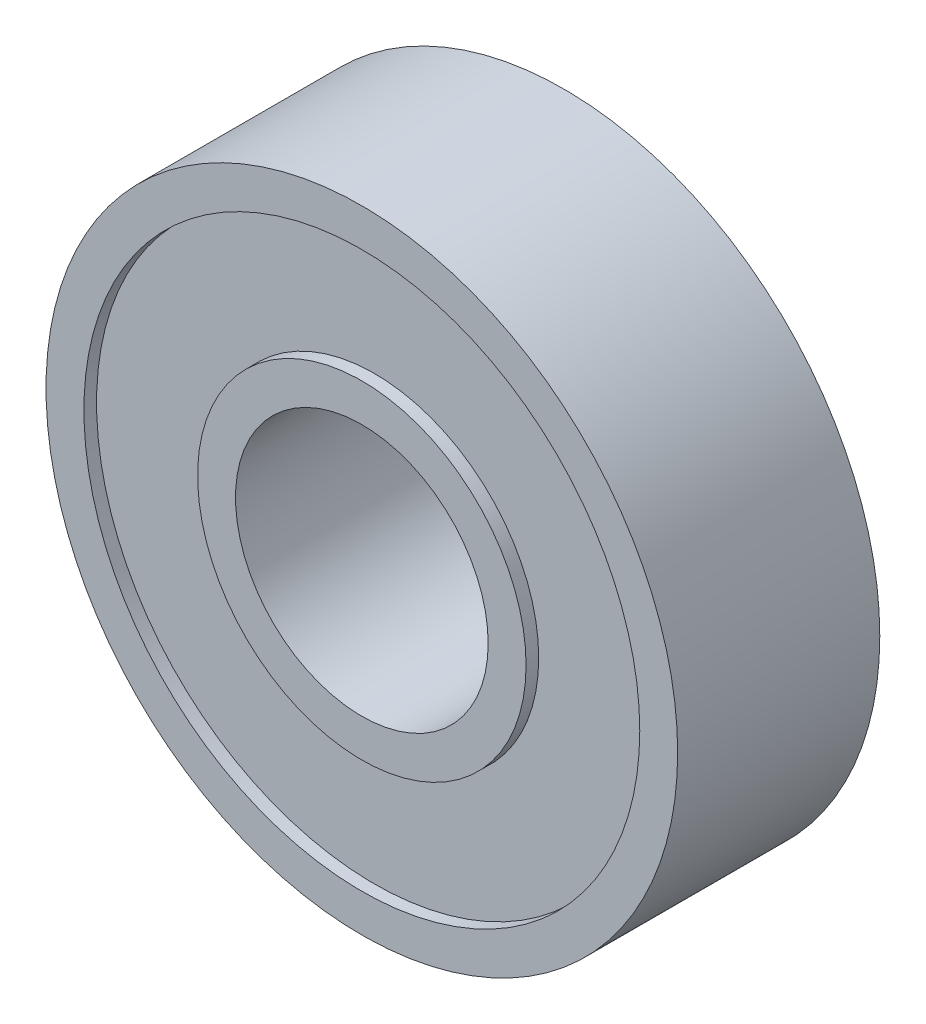
ISO-10303-21;
HEADER;
FILE_DESCRIPTION(('STEP AP214'),'2;1');
FILE_NAME('part.step','',(''),(''),'','','');
FILE_SCHEMA(('AUTOMOTIVE_DESIGN { 1 0 10303 214 1 1 1 1 }'));
ENDSEC;
DATA;
#1=APPLICATION_CONTEXT('core data for automotive mechanical design processes');
#2=APPLICATION_PROTOCOL_DEFINITION('international standard','automotive_design',2000,#1);
#3=PRODUCT_CONTEXT('',#1,'mechanical');
#4=PRODUCT('Part','Part','',(#3));
#5=PRODUCT_RELATED_PRODUCT_CATEGORY('part','',(#4));
#6=PRODUCT_DEFINITION_FORMATION('','',#4);
#7=PRODUCT_DEFINITION_CONTEXT('part definition',#1,'design');
#8=PRODUCT_DEFINITION('design','',#6,#7);
#9=PRODUCT_DEFINITION_SHAPE('','',#8);
#10=(LENGTH_UNIT() NAMED_UNIT(*) SI_UNIT(.MILLI.,.METRE.));
#11=(NAMED_UNIT(*) PLANE_ANGLE_UNIT() SI_UNIT($,.RADIAN.));
#12=(NAMED_UNIT(*) SI_UNIT($,.STERADIAN.) SOLID_ANGLE_UNIT());
#13=UNCERTAINTY_MEASURE_WITH_UNIT(LENGTH_MEASURE(1.E-05),#10,'distance_accuracy_value','');
#14=(GEOMETRIC_REPRESENTATION_CONTEXT(3) GLOBAL_UNCERTAINTY_ASSIGNED_CONTEXT((#13)) GLOBAL_UNIT_ASSIGNED_CONTEXT((#10,
#11,#12)) REPRESENTATION_CONTEXT('',''));
#15=CARTESIAN_POINT('',(0.,0.,0.));
#16=DIRECTION('',(0.,0.,1.));
#17=DIRECTION('',(1.,0.,0.));
#18=AXIS2_PLACEMENT_3D('',#15,#16,#17);
#19=CARTESIAN_POINT('',(0.,0.,-4.));
#20=DIRECTION('',(0.,0.,1.));
#21=DIRECTION('',(1.,0.,0.));
#22=AXIS2_PLACEMENT_3D('',#19,#20,#21);
#23=CYLINDRICAL_SURFACE('',#22,11.);
#24=CARTESIAN_POINT('',(0.,0.,-4.));
#25=DIRECTION('',(0.,0.,1.));
#26=DIRECTION('',(1.,0.,0.));
#27=AXIS2_PLACEMENT_3D('',#24,#25,#26);
#28=CIRCLE('',#27,11.);
#29=CARTESIAN_POINT('',(11.,0.,-4.));
#30=VERTEX_POINT('',#29);
#31=EDGE_CURVE('E57',#30,#30,#28,.T.);
#32=ORIENTED_EDGE('',*,*,#31,.F.);
#33=EDGE_LOOP('',(#32));
#34=FACE_BOUND('',#33,.T.);
#35=CARTESIAN_POINT('',(0.,0.,-3.5));
#36=DIRECTION('',(0.,0.,1.));
#37=DIRECTION('',(1.,0.,0.));
#38=AXIS2_PLACEMENT_3D('',#35,#36,#37);
#39=CIRCLE('',#38,11.);
#40=CARTESIAN_POINT('',(11.,0.,-3.5));
#41=VERTEX_POINT('',#40);
#42=EDGE_CURVE('E11',#41,#41,#39,.F.);
#43=ORIENTED_EDGE('',*,*,#42,.F.);
#44=EDGE_LOOP('',(#43));
#45=FACE_BOUND('',#44,.T.);
#46=ADVANCED_FACE('F46',(#34,#45),#23,.F.);
#47=CARTESIAN_POINT('',(0.,0.,3.5));
#48=DIRECTION('',(0.,0.,1.));
#49=DIRECTION('',(1.,0.,0.));
#50=AXIS2_PLACEMENT_3D('',#47,#48,#49);
#51=CIRCLE('',#50,11.);
#52=CARTESIAN_POINT('',(11.,0.,3.5));
#53=VERTEX_POINT('',#52);
#54=EDGE_CURVE('E69',#53,#53,#51,.T.);
#55=ORIENTED_EDGE('',*,*,#54,.F.);
#56=EDGE_LOOP('',(#55));
#57=FACE_BOUND('',#56,.T.);
#58=CARTESIAN_POINT('',(0.,0.,4.));
#59=DIRECTION('',(0.,0.,1.));
#60=DIRECTION('',(1.,0.,0.));
#61=AXIS2_PLACEMENT_3D('',#58,#59,#60);
#62=CIRCLE('',#61,11.);
#63=CARTESIAN_POINT('',(11.,0.,4.));
#64=VERTEX_POINT('',#63);
#65=EDGE_CURVE('E66',#64,#64,#62,.T.);
#66=ORIENTED_EDGE('',*,*,#65,.T.);
#67=EDGE_LOOP('',(#66));
#68=FACE_BOUND('',#67,.T.);
#69=ADVANCED_FACE('F48',(#57,#68),#23,.F.);
#70=CARTESIAN_POINT('',(0.,0.,-4.));
#71=DIRECTION('',(0.,0.,1.));
#72=DIRECTION('',(1.,0.,0.));
#73=AXIS2_PLACEMENT_3D('',#70,#71,#72);
#74=CYLINDRICAL_SURFACE('',#73,12.5);
#75=CARTESIAN_POINT('',(0.,0.,-4.));
#76=DIRECTION('',(0.,0.,1.));
#77=DIRECTION('',(1.,0.,0.));
#78=AXIS2_PLACEMENT_3D('',#75,#76,#77);
#79=CIRCLE('',#78,12.5);
#80=CARTESIAN_POINT('',(12.5,0.,-4.));
#81=VERTEX_POINT('',#80);
#82=EDGE_CURVE('E53',#81,#81,#79,.T.);
#83=ORIENTED_EDGE('',*,*,#82,.T.);
#84=EDGE_LOOP('',(#83));
#85=FACE_BOUND('',#84,.T.);
#86=CARTESIAN_POINT('',(0.,0.,4.));
#87=DIRECTION('',(0.,0.,1.));
#88=DIRECTION('',(1.,0.,0.));
#89=AXIS2_PLACEMENT_3D('',#86,#87,#88);
#90=CIRCLE('',#89,12.5);
#91=CARTESIAN_POINT('',(12.5,0.,4.));
#92=VERTEX_POINT('',#91);
#93=EDGE_CURVE('E61',#92,#92,#90,.T.);
#94=ORIENTED_EDGE('',*,*,#93,.F.);
#95=EDGE_LOOP('',(#94));
#96=FACE_BOUND('',#95,.T.);
#97=ADVANCED_FACE('F121',(#85,#96),#74,.T.);
#98=CARTESIAN_POINT('',(0.,0.,-4.));
#99=DIRECTION('',(0.,0.,1.));
#100=DIRECTION('',(1.,0.,0.));
#101=AXIS2_PLACEMENT_3D('',#98,#99,#100);
#102=PLANE('',#101);
#103=ORIENTED_EDGE('',*,*,#31,.T.);
#104=EDGE_LOOP('',(#103));
#105=FACE_BOUND('',#104,.T.);
#106=ORIENTED_EDGE('',*,*,#82,.F.);
#107=EDGE_LOOP('',(#106));
#108=FACE_BOUND('',#107,.T.);
#109=ADVANCED_FACE('F126',(#105,#108),#102,.F.);
#110=CARTESIAN_POINT('',(0.,0.,4.));
#111=DIRECTION('',(0.,0.,1.));
#112=DIRECTION('',(1.,0.,0.));
#113=AXIS2_PLACEMENT_3D('',#110,#111,#112);
#114=PLANE('',#113);
#115=ORIENTED_EDGE('',*,*,#65,.F.);
#116=EDGE_LOOP('',(#115));
#117=FACE_BOUND('',#116,.T.);
#118=ORIENTED_EDGE('',*,*,#93,.T.);
#119=EDGE_LOOP('',(#118));
#120=FACE_BOUND('',#119,.T.);
#121=ADVANCED_FACE('F129',(#117,#120),#114,.T.);
#122=CARTESIAN_POINT('',(0.,0.,-3.5));
#123=DIRECTION('',(0.,0.,1.));
#124=DIRECTION('',(1.,0.,0.));
#125=AXIS2_PLACEMENT_3D('',#122,#123,#124);
#126=PLANE('',#125);
#127=CARTESIAN_POINT('',(0.,0.,-3.5));
#128=DIRECTION('',(0.,0.,1.));
#129=DIRECTION('',(1.,0.,0.));
#130=AXIS2_PLACEMENT_3D('',#127,#128,#129);
#131=CIRCLE('',#130,6.5);
#132=CARTESIAN_POINT('',(6.5,0.,-3.5));
#133=VERTEX_POINT('',#132);
#134=EDGE_CURVE('E75',#133,#133,#131,.T.);
#135=ORIENTED_EDGE('',*,*,#134,.T.);
#136=EDGE_LOOP('',(#135));
#137=FACE_BOUND('',#136,.T.);
#138=ORIENTED_EDGE('',*,*,#42,.T.);
#139=EDGE_LOOP('',(#138));
#140=FACE_BOUND('',#139,.T.);
#141=ADVANCED_FACE('F135',(#137,#140),#126,.F.);
#142=CARTESIAN_POINT('',(0.,0.,3.5));
#143=DIRECTION('',(0.,0.,1.));
#144=DIRECTION('',(1.,0.,0.));
#145=AXIS2_PLACEMENT_3D('',#142,#143,#144);
#146=PLANE('',#145);
#147=CARTESIAN_POINT('',(0.,0.,3.5));
#148=DIRECTION('',(0.,0.,1.));
#149=DIRECTION('',(1.,0.,0.));
#150=AXIS2_PLACEMENT_3D('',#147,#148,#149);
#151=CIRCLE('',#150,6.5);
#152=CARTESIAN_POINT('',(6.5,0.,3.5));
#153=VERTEX_POINT('',#152);
#154=EDGE_CURVE('E72',#153,#153,#151,.T.);
#155=ORIENTED_EDGE('',*,*,#154,.F.);
#156=EDGE_LOOP('',(#155));
#157=FACE_BOUND('',#156,.T.);
#158=ORIENTED_EDGE('',*,*,#54,.T.);
#159=EDGE_LOOP('',(#158));
#160=FACE_BOUND('',#159,.T.);
#161=ADVANCED_FACE('F114',(#157,#160),#146,.T.);
#162=CARTESIAN_POINT('',(0.,0.,-4.));
#163=DIRECTION('',(0.,0.,1.));
#164=DIRECTION('',(1.,0.,0.));
#165=AXIS2_PLACEMENT_3D('',#162,#163,#164);
#166=CYLINDRICAL_SURFACE('',#165,6.5);
#167=CARTESIAN_POINT('',(0.,0.,-4.));
#168=DIRECTION('',(0.,0.,1.));
#169=DIRECTION('',(1.,0.,0.));
#170=AXIS2_PLACEMENT_3D('',#167,#168,#169);
#171=CIRCLE('',#170,6.5);
#172=CARTESIAN_POINT('',(6.5,0.,-4.));
#173=VERTEX_POINT('',#172);
#174=EDGE_CURVE('E78',#173,#173,#171,.T.);
#175=ORIENTED_EDGE('',*,*,#174,.T.);
#176=EDGE_LOOP('',(#175));
#177=FACE_BOUND('',#176,.T.);
#178=ORIENTED_EDGE('',*,*,#134,.F.);
#179=EDGE_LOOP('',(#178));
#180=FACE_BOUND('',#179,.T.);
#181=ADVANCED_FACE('F104',(#177,#180),#166,.T.);
#182=CARTESIAN_POINT('',(0.,0.,-4.));
#183=DIRECTION('',(0.,0.,1.));
#184=DIRECTION('',(1.,0.,0.));
#185=AXIS2_PLACEMENT_3D('',#182,#183,#184);
#186=CYLINDRICAL_SURFACE('',#185,5.);
#187=CARTESIAN_POINT('',(0.,0.,-4.));
#188=DIRECTION('',(0.,0.,1.));
#189=DIRECTION('',(1.,0.,0.));
#190=AXIS2_PLACEMENT_3D('',#187,#188,#189);
#191=CIRCLE('',#190,5.);
#192=CARTESIAN_POINT('',(5.,0.,-4.));
#193=VERTEX_POINT('',#192);
#194=EDGE_CURVE('E81',#193,#193,#191,.T.);
#195=ORIENTED_EDGE('',*,*,#194,.F.);
#196=EDGE_LOOP('',(#195));
#197=FACE_BOUND('',#196,.T.);
#198=CARTESIAN_POINT('',(0.,0.,4.));
#199=DIRECTION('',(0.,0.,1.));
#200=DIRECTION('',(1.,0.,0.));
#201=AXIS2_PLACEMENT_3D('',#198,#199,#200);
#202=CIRCLE('',#201,5.);
#203=CARTESIAN_POINT('',(5.,0.,4.));
#204=VERTEX_POINT('',#203);
#205=EDGE_CURVE('E87',#204,#204,#202,.T.);
#206=ORIENTED_EDGE('',*,*,#205,.T.);
#207=EDGE_LOOP('',(#206));
#208=FACE_BOUND('',#207,.T.);
#209=ADVANCED_FACE('F91',(#197,#208),#186,.F.);
#210=ORIENTED_EDGE('',*,*,#154,.T.);
#211=EDGE_LOOP('',(#210));
#212=FACE_BOUND('',#211,.T.);
#213=CARTESIAN_POINT('',(0.,0.,4.));
#214=DIRECTION('',(0.,0.,1.));
#215=DIRECTION('',(1.,0.,0.));
#216=AXIS2_PLACEMENT_3D('',#213,#214,#215);
#217=CIRCLE('',#216,6.5);
#218=CARTESIAN_POINT('',(6.5,0.,4.));
#219=VERTEX_POINT('',#218);
#220=EDGE_CURVE('E84',#219,#219,#217,.T.);
#221=ORIENTED_EDGE('',*,*,#220,.F.);
#222=EDGE_LOOP('',(#221));
#223=FACE_BOUND('',#222,.T.);
#224=ADVANCED_FACE('F100',(#212,#223),#166,.T.);
#225=CARTESIAN_POINT('',(0.,0.,-4.));
#226=DIRECTION('',(0.,0.,1.));
#227=DIRECTION('',(1.,0.,0.));
#228=AXIS2_PLACEMENT_3D('',#225,#226,#227);
#229=PLANE('',#228);
#230=ORIENTED_EDGE('',*,*,#194,.T.);
#231=EDGE_LOOP('',(#230));
#232=FACE_BOUND('',#231,.T.);
#233=ORIENTED_EDGE('',*,*,#174,.F.);
#234=EDGE_LOOP('',(#233));
#235=FACE_BOUND('',#234,.T.);
#236=ADVANCED_FACE('F96',(#232,#235),#229,.F.);
#237=CARTESIAN_POINT('',(0.,0.,4.));
#238=DIRECTION('',(0.,0.,1.));
#239=DIRECTION('',(1.,0.,0.));
#240=AXIS2_PLACEMENT_3D('',#237,#238,#239);
#241=PLANE('',#240);
#242=ORIENTED_EDGE('',*,*,#205,.F.);
#243=EDGE_LOOP('',(#242));
#244=FACE_BOUND('',#243,.T.);
#245=ORIENTED_EDGE('',*,*,#220,.T.);
#246=EDGE_LOOP('',(#245));
#247=FACE_BOUND('',#246,.T.);
#248=ADVANCED_FACE('F93',(#244,#247),#241,.T.);
#249=CLOSED_SHELL('',(#46,#69,#97,#109,#121,#141,#161,#181,#209,#224,#236,#248));
#250=MANIFOLD_SOLID_BREP('B2',#249);
#251=ADVANCED_BREP_SHAPE_REPRESENTATION('',(#18,#250),#14);
#252=SHAPE_DEFINITION_REPRESENTATION(#9,#251);
ENDSEC;
END-ISO-10303-21;
